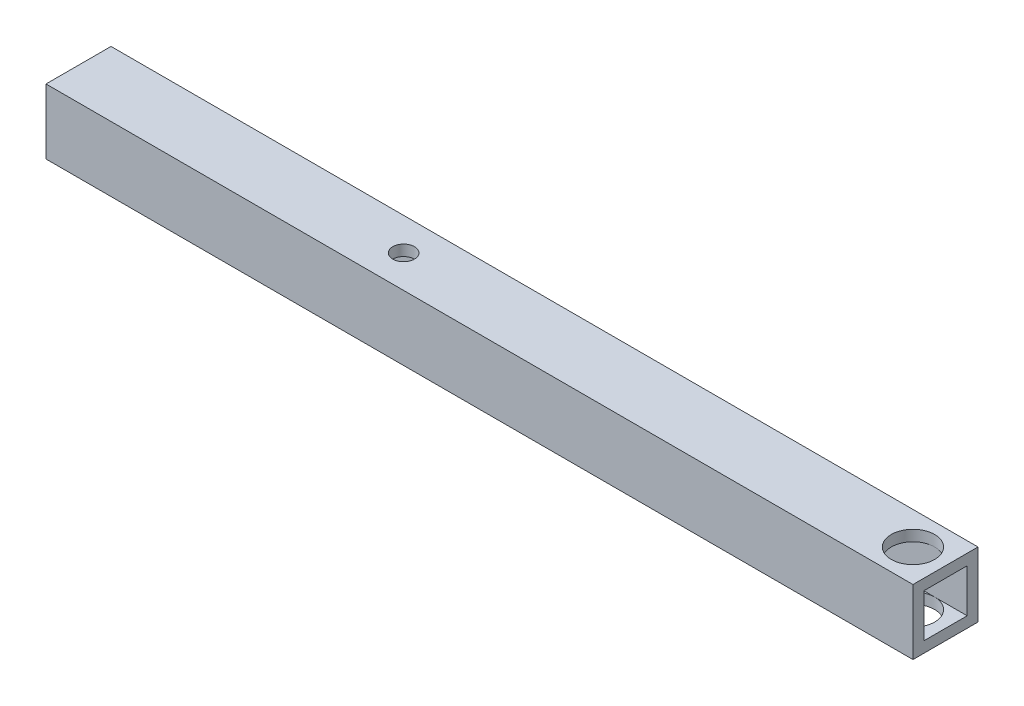
ISO-10303-21;
HEADER;
FILE_DESCRIPTION(('STEP AP214'),'2;1');
FILE_NAME('part.step','',(''),(''),'','','');
FILE_SCHEMA(('AUTOMOTIVE_DESIGN { 1 0 10303 214 1 1 1 1 }'));
ENDSEC;
DATA;
#1=APPLICATION_CONTEXT('core data for automotive mechanical design processes');
#2=APPLICATION_PROTOCOL_DEFINITION('international standard','automotive_design',2000,#1);
#3=PRODUCT_CONTEXT('',#1,'mechanical');
#4=PRODUCT('Part','Part','',(#3));
#5=PRODUCT_RELATED_PRODUCT_CATEGORY('part','',(#4));
#6=PRODUCT_DEFINITION_FORMATION('','',#4);
#7=PRODUCT_DEFINITION_CONTEXT('part definition',#1,'design');
#8=PRODUCT_DEFINITION('design','',#6,#7);
#9=PRODUCT_DEFINITION_SHAPE('','',#8);
#10=(LENGTH_UNIT() NAMED_UNIT(*) SI_UNIT(.MILLI.,.METRE.));
#11=(NAMED_UNIT(*) PLANE_ANGLE_UNIT() SI_UNIT($,.RADIAN.));
#12=(NAMED_UNIT(*) SI_UNIT($,.STERADIAN.) SOLID_ANGLE_UNIT());
#13=UNCERTAINTY_MEASURE_WITH_UNIT(LENGTH_MEASURE(1.E-05),#10,'distance_accuracy_value','');
#14=(GEOMETRIC_REPRESENTATION_CONTEXT(3) GLOBAL_UNCERTAINTY_ASSIGNED_CONTEXT((#13)) GLOBAL_UNIT_ASSIGNED_CONTEXT((#10,
#11,#12)) REPRESENTATION_CONTEXT('',''));
#15=CARTESIAN_POINT('',(0.,0.,0.));
#16=DIRECTION('',(0.,0.,1.));
#17=DIRECTION('',(1.,0.,0.));
#18=AXIS2_PLACEMENT_3D('',#15,#16,#17);
#19=CARTESIAN_POINT('',(200.,-5.,-5.));
#20=DIRECTION('',(0.,1.,0.));
#21=DIRECTION('',(0.,0.,1.));
#22=AXIS2_PLACEMENT_3D('',#19,#20,#21);
#23=PLANE('',#22);
#24=CARTESIAN_POINT('',(192.5,-5.,0.));
#25=DIRECTION('',(0.,1.,0.));
#26=DIRECTION('',(0.,0.,1.));
#27=AXIS2_PLACEMENT_3D('',#24,#25,#26);
#28=CIRCLE('',#27,4.99999999999999);
#29=CARTESIAN_POINT('',(192.5,-5.,5.));
#30=VERTEX_POINT('',#29);
#31=CARTESIAN_POINT('',(192.5,-5.,-5.));
#32=VERTEX_POINT('',#31);
#33=EDGE_CURVE('E55',#30,#32,#28,.T.);
#34=ORIENTED_EDGE('',*,*,#33,.F.);
#35=DIRECTION('',(-1.,0.,0.));
#36=VECTOR('',#35,1.);
#37=CARTESIAN_POINT('',(200.,-5.,5.));
#38=LINE('',#37,#36);
#39=CARTESIAN_POINT('',(200.,-5.,5.));
#40=VERTEX_POINT('',#39);
#41=EDGE_CURVE('E154',#40,#30,#38,.T.);
#42=ORIENTED_EDGE('',*,*,#41,.F.);
#43=DIRECTION('',(0.,0.,-1.));
#44=VECTOR('',#43,1.);
#45=CARTESIAN_POINT('',(200.,-5.,-5.));
#46=LINE('',#45,#44);
#47=CARTESIAN_POINT('',(200.,-5.,-5.));
#48=VERTEX_POINT('',#47);
#49=EDGE_CURVE('E227',#40,#48,#46,.T.);
#50=ORIENTED_EDGE('',*,*,#49,.T.);
#51=DIRECTION('',(-1.,0.,0.));
#52=VECTOR('',#51,1.);
#53=CARTESIAN_POINT('',(200.,-5.,-5.));
#54=LINE('',#53,#52);
#55=EDGE_CURVE('E146',#48,#32,#54,.T.);
#56=ORIENTED_EDGE('',*,*,#55,.T.);
#57=EDGE_LOOP('',(#34,#42,#50,#56));
#58=FACE_BOUND('',#57,.T.);
#59=ADVANCED_FACE('F39',(#58),#23,.T.);
#60=CARTESIAN_POINT('',(200.,5.,-5.));
#61=DIRECTION('',(0.,-1.,0.));
#62=DIRECTION('',(0.,0.,-1.));
#63=AXIS2_PLACEMENT_3D('',#60,#61,#62);
#64=PLANE('',#63);
#65=CARTESIAN_POINT('',(192.5,5.,0.));
#66=DIRECTION('',(0.,-1.,0.));
#67=DIRECTION('',(0.,0.,-1.));
#68=AXIS2_PLACEMENT_3D('',#65,#66,#67);
#69=CIRCLE('',#68,4.99999999999999);
#70=CARTESIAN_POINT('',(192.5,5.,-5.));
#71=VERTEX_POINT('',#70);
#72=CARTESIAN_POINT('',(192.5,5.,5.));
#73=VERTEX_POINT('',#72);
#74=EDGE_CURVE('E11',#71,#73,#69,.T.);
#75=ORIENTED_EDGE('',*,*,#74,.F.);
#76=DIRECTION('',(-1.,0.,0.));
#77=VECTOR('',#76,1.);
#78=CARTESIAN_POINT('',(200.,5.,-5.));
#79=LINE('',#78,#77);
#80=CARTESIAN_POINT('',(200.,5.,-5.));
#81=VERTEX_POINT('',#80);
#82=EDGE_CURVE('E124',#81,#71,#79,.T.);
#83=ORIENTED_EDGE('',*,*,#82,.F.);
#84=DIRECTION('',(0.,0.,1.));
#85=VECTOR('',#84,1.);
#86=CARTESIAN_POINT('',(200.,5.,-5.));
#87=LINE('',#86,#85);
#88=CARTESIAN_POINT('',(200.,5.,5.));
#89=VERTEX_POINT('',#88);
#90=EDGE_CURVE('E226',#81,#89,#87,.T.);
#91=ORIENTED_EDGE('',*,*,#90,.T.);
#92=DIRECTION('',(-1.,0.,0.));
#93=VECTOR('',#92,1.);
#94=CARTESIAN_POINT('',(200.,5.,5.));
#95=LINE('',#94,#93);
#96=EDGE_CURVE('E127',#89,#73,#95,.T.);
#97=ORIENTED_EDGE('',*,*,#96,.T.);
#98=EDGE_LOOP('',(#75,#83,#91,#97));
#99=FACE_BOUND('',#98,.T.);
#100=ADVANCED_FACE('F122',(#99),#64,.T.);
#101=CARTESIAN_POINT('',(200.,0.,0.));
#102=DIRECTION('',(-1.,0.,0.));
#103=DIRECTION('',(0.,0.,1.));
#104=AXIS2_PLACEMENT_3D('',#101,#102,#103);
#105=PLANE('',#104);
#106=DIRECTION('',(0.,1.,0.));
#107=VECTOR('',#106,1.);
#108=CARTESIAN_POINT('',(200.,-7.5,-7.5));
#109=LINE('',#108,#107);
#110=CARTESIAN_POINT('',(200.,-7.5,-7.5));
#111=VERTEX_POINT('',#110);
#112=CARTESIAN_POINT('',(200.,7.5,-7.5));
#113=VERTEX_POINT('',#112);
#114=EDGE_CURVE('E159',#111,#113,#109,.T.);
#115=ORIENTED_EDGE('',*,*,#114,.T.);
#116=DIRECTION('',(0.,0.,1.));
#117=VECTOR('',#116,1.);
#118=CARTESIAN_POINT('',(200.,7.5,7.5));
#119=LINE('',#118,#117);
#120=CARTESIAN_POINT('',(200.,7.5,7.5));
#121=VERTEX_POINT('',#120);
#122=EDGE_CURVE('E163',#113,#121,#119,.T.);
#123=ORIENTED_EDGE('',*,*,#122,.T.);
#124=DIRECTION('',(0.,-1.,0.));
#125=VECTOR('',#124,1.);
#126=CARTESIAN_POINT('',(200.,-7.5,7.5));
#127=LINE('',#126,#125);
#128=CARTESIAN_POINT('',(200.,-7.5,7.5));
#129=VERTEX_POINT('',#128);
#130=EDGE_CURVE('E167',#121,#129,#127,.T.);
#131=ORIENTED_EDGE('',*,*,#130,.T.);
#132=DIRECTION('',(0.,0.,-1.));
#133=VECTOR('',#132,1.);
#134=CARTESIAN_POINT('',(200.,-7.5,7.5));
#135=LINE('',#134,#133);
#136=EDGE_CURVE('E170',#129,#111,#135,.T.);
#137=ORIENTED_EDGE('',*,*,#136,.T.);
#138=EDGE_LOOP('',(#115,#123,#131,#137));
#139=FACE_BOUND('',#138,.T.);
#140=DIRECTION('',(0.,-1.,0.));
#141=VECTOR('',#140,1.);
#142=CARTESIAN_POINT('',(200.,-5.,5.));
#143=LINE('',#142,#141);
#144=EDGE_CURVE('E225',#89,#40,#143,.T.);
#145=ORIENTED_EDGE('',*,*,#144,.F.);
#146=ORIENTED_EDGE('',*,*,#90,.F.);
#147=DIRECTION('',(0.,1.,0.));
#148=VECTOR('',#147,1.);
#149=CARTESIAN_POINT('',(200.,-5.,-5.));
#150=LINE('',#149,#148);
#151=EDGE_CURVE('E141',#48,#81,#150,.T.);
#152=ORIENTED_EDGE('',*,*,#151,.F.);
#153=ORIENTED_EDGE('',*,*,#49,.F.);
#154=EDGE_LOOP('',(#145,#146,#152,#153));
#155=FACE_BOUND('',#154,.T.);
#156=ADVANCED_FACE('F219',(#139,#155),#105,.F.);
#157=CARTESIAN_POINT('',(0.,0.,0.));
#158=DIRECTION('',(-1.,0.,0.));
#159=DIRECTION('',(0.,0.,1.));
#160=AXIS2_PLACEMENT_3D('',#157,#158,#159);
#161=PLANE('',#160);
#162=DIRECTION('',(0.,1.,0.));
#163=VECTOR('',#162,1.);
#164=CARTESIAN_POINT('',(0.,-7.5,-7.5));
#165=LINE('',#164,#163);
#166=CARTESIAN_POINT('',(0.,-7.5,-7.5));
#167=VERTEX_POINT('',#166);
#168=CARTESIAN_POINT('',(0.,7.5,-7.5));
#169=VERTEX_POINT('',#168);
#170=EDGE_CURVE('E158',#167,#169,#165,.T.);
#171=ORIENTED_EDGE('',*,*,#170,.F.);
#172=DIRECTION('',(0.,0.,-1.));
#173=VECTOR('',#172,1.);
#174=CARTESIAN_POINT('',(0.,-7.5,7.5));
#175=LINE('',#174,#173);
#176=CARTESIAN_POINT('',(0.,-7.5,7.5));
#177=VERTEX_POINT('',#176);
#178=EDGE_CURVE('E164',#177,#167,#175,.T.);
#179=ORIENTED_EDGE('',*,*,#178,.F.);
#180=DIRECTION('',(0.,-1.,0.));
#181=VECTOR('',#180,1.);
#182=CARTESIAN_POINT('',(0.,-7.5,7.5));
#183=LINE('',#182,#181);
#184=CARTESIAN_POINT('',(0.,7.5,7.5));
#185=VERTEX_POINT('',#184);
#186=EDGE_CURVE('E180',#185,#177,#183,.T.);
#187=ORIENTED_EDGE('',*,*,#186,.F.);
#188=DIRECTION('',(0.,0.,1.));
#189=VECTOR('',#188,1.);
#190=CARTESIAN_POINT('',(0.,7.5,7.5));
#191=LINE('',#190,#189);
#192=EDGE_CURVE('E177',#169,#185,#191,.T.);
#193=ORIENTED_EDGE('',*,*,#192,.F.);
#194=EDGE_LOOP('',(#171,#179,#187,#193));
#195=FACE_BOUND('',#194,.T.);
#196=DIRECTION('',(0.,0.,1.));
#197=VECTOR('',#196,1.);
#198=CARTESIAN_POINT('',(0.,5.,-5.));
#199=LINE('',#198,#197);
#200=CARTESIAN_POINT('',(0.,5.,-5.));
#201=VERTEX_POINT('',#200);
#202=CARTESIAN_POINT('',(0.,5.,5.));
#203=VERTEX_POINT('',#202);
#204=EDGE_CURVE('E132',#201,#203,#199,.T.);
#205=ORIENTED_EDGE('',*,*,#204,.T.);
#206=DIRECTION('',(0.,-1.,0.));
#207=VECTOR('',#206,1.);
#208=CARTESIAN_POINT('',(0.,-5.,5.));
#209=LINE('',#208,#207);
#210=CARTESIAN_POINT('',(0.,-5.,5.));
#211=VERTEX_POINT('',#210);
#212=EDGE_CURVE('E245',#203,#211,#209,.T.);
#213=ORIENTED_EDGE('',*,*,#212,.T.);
#214=DIRECTION('',(0.,0.,-1.));
#215=VECTOR('',#214,1.);
#216=CARTESIAN_POINT('',(0.,-5.,-5.));
#217=LINE('',#216,#215);
#218=CARTESIAN_POINT('',(0.,-5.,-5.));
#219=VERTEX_POINT('',#218);
#220=EDGE_CURVE('E249',#211,#219,#217,.T.);
#221=ORIENTED_EDGE('',*,*,#220,.T.);
#222=DIRECTION('',(0.,1.,0.));
#223=VECTOR('',#222,1.);
#224=CARTESIAN_POINT('',(0.,-5.,-5.));
#225=LINE('',#224,#223);
#226=EDGE_CURVE('E235',#219,#201,#225,.T.);
#227=ORIENTED_EDGE('',*,*,#226,.T.);
#228=EDGE_LOOP('',(#205,#213,#221,#227));
#229=FACE_BOUND('',#228,.T.);
#230=ADVANCED_FACE('F208',(#195,#229),#161,.T.);
#231=CARTESIAN_POINT('',(200.,-7.5,-7.5));
#232=DIRECTION('',(0.,0.,1.));
#233=DIRECTION('',(1.,0.,0.));
#234=AXIS2_PLACEMENT_3D('',#231,#232,#233);
#235=PLANE('',#234);
#236=ORIENTED_EDGE('',*,*,#170,.T.);
#237=DIRECTION('',(-1.,0.,0.));
#238=VECTOR('',#237,1.);
#239=CARTESIAN_POINT('',(200.,7.5,-7.5));
#240=LINE('',#239,#238);
#241=EDGE_CURVE('E119',#113,#169,#240,.T.);
#242=ORIENTED_EDGE('',*,*,#241,.F.);
#243=ORIENTED_EDGE('',*,*,#114,.F.);
#244=DIRECTION('',(-1.,0.,0.));
#245=VECTOR('',#244,1.);
#246=CARTESIAN_POINT('',(200.,-7.5,-7.5));
#247=LINE('',#246,#245);
#248=EDGE_CURVE('E173',#111,#167,#247,.T.);
#249=ORIENTED_EDGE('',*,*,#248,.T.);
#250=EDGE_LOOP('',(#236,#242,#243,#249));
#251=FACE_BOUND('',#250,.T.);
#252=ADVANCED_FACE('F41',(#251),#235,.F.);
#253=CARTESIAN_POINT('',(200.,7.5,7.5));
#254=DIRECTION('',(0.,-1.,0.));
#255=DIRECTION('',(0.,0.,-1.));
#256=AXIS2_PLACEMENT_3D('',#253,#254,#255);
#257=PLANE('',#256);
#258=CARTESIAN_POINT('',(75.,7.5,0.));
#259=DIRECTION('',(0.,1.,0.));
#260=DIRECTION('',(0.,0.,1.));
#261=AXIS2_PLACEMENT_3D('',#258,#259,#260);
#262=CIRCLE('',#261,2.49999999999999);
#263=CARTESIAN_POINT('',(75.,7.5,2.49999999999999));
#264=VERTEX_POINT('',#263);
#265=EDGE_CURVE('E292',#264,#264,#262,.T.);
#266=ORIENTED_EDGE('',*,*,#265,.F.);
#267=EDGE_LOOP('',(#266));
#268=FACE_BOUND('',#267,.T.);
#269=CARTESIAN_POINT('',(192.5,7.5,0.));
#270=DIRECTION('',(0.,1.,0.));
#271=DIRECTION('',(0.,0.,1.));
#272=AXIS2_PLACEMENT_3D('',#269,#270,#271);
#273=CIRCLE('',#272,4.99999999999999);
#274=CARTESIAN_POINT('',(192.5,7.5,4.99999999999999));
#275=VERTEX_POINT('',#274);
#276=EDGE_CURVE('E306',#275,#275,#273,.T.);
#277=ORIENTED_EDGE('',*,*,#276,.F.);
#278=EDGE_LOOP('',(#277));
#279=FACE_BOUND('',#278,.T.);
#280=ORIENTED_EDGE('',*,*,#192,.T.);
#281=DIRECTION('',(-1.,0.,0.));
#282=VECTOR('',#281,1.);
#283=CARTESIAN_POINT('',(200.,7.5,7.5));
#284=LINE('',#283,#282);
#285=EDGE_CURVE('E192',#121,#185,#284,.T.);
#286=ORIENTED_EDGE('',*,*,#285,.F.);
#287=ORIENTED_EDGE('',*,*,#122,.F.);
#288=ORIENTED_EDGE('',*,*,#241,.T.);
#289=EDGE_LOOP('',(#280,#286,#287,#288));
#290=FACE_BOUND('',#289,.T.);
#291=ADVANCED_FACE('F200',(#268,#279,#290),#257,.F.);
#292=CARTESIAN_POINT('',(200.,-7.5,7.5));
#293=DIRECTION('',(0.,0.,-1.));
#294=DIRECTION('',(-1.,0.,0.));
#295=AXIS2_PLACEMENT_3D('',#292,#293,#294);
#296=PLANE('',#295);
#297=ORIENTED_EDGE('',*,*,#186,.T.);
#298=DIRECTION('',(-1.,0.,0.));
#299=VECTOR('',#298,1.);
#300=CARTESIAN_POINT('',(200.,-7.5,7.5));
#301=LINE('',#300,#299);
#302=EDGE_CURVE('E188',#129,#177,#301,.T.);
#303=ORIENTED_EDGE('',*,*,#302,.F.);
#304=ORIENTED_EDGE('',*,*,#130,.F.);
#305=ORIENTED_EDGE('',*,*,#285,.T.);
#306=EDGE_LOOP('',(#297,#303,#304,#305));
#307=FACE_BOUND('',#306,.T.);
#308=ADVANCED_FACE('F213',(#307),#296,.F.);
#309=CARTESIAN_POINT('',(200.,-7.5,7.5));
#310=DIRECTION('',(0.,1.,0.));
#311=DIRECTION('',(0.,0.,1.));
#312=AXIS2_PLACEMENT_3D('',#309,#310,#311);
#313=PLANE('',#312);
#314=CARTESIAN_POINT('',(75.,-7.50000000000001,0.));
#315=DIRECTION('',(0.,1.,0.));
#316=DIRECTION('',(0.,0.,1.));
#317=AXIS2_PLACEMENT_3D('',#314,#315,#316);
#318=CIRCLE('',#317,2.49999999999999);
#319=CARTESIAN_POINT('',(75.,-7.50000000000001,2.49999999999999));
#320=VERTEX_POINT('',#319);
#321=EDGE_CURVE('E296',#320,#320,#318,.T.);
#322=ORIENTED_EDGE('',*,*,#321,.T.);
#323=EDGE_LOOP('',(#322));
#324=FACE_BOUND('',#323,.T.);
#325=CARTESIAN_POINT('',(192.5,-7.5,0.));
#326=DIRECTION('',(0.,1.,0.));
#327=DIRECTION('',(0.,0.,1.));
#328=AXIS2_PLACEMENT_3D('',#325,#326,#327);
#329=CIRCLE('',#328,4.99999999999999);
#330=CARTESIAN_POINT('',(192.5,-7.5,4.99999999999999));
#331=VERTEX_POINT('',#330);
#332=EDGE_CURVE('E307',#331,#331,#329,.T.);
#333=ORIENTED_EDGE('',*,*,#332,.T.);
#334=EDGE_LOOP('',(#333));
#335=FACE_BOUND('',#334,.T.);
#336=ORIENTED_EDGE('',*,*,#178,.T.);
#337=ORIENTED_EDGE('',*,*,#248,.F.);
#338=ORIENTED_EDGE('',*,*,#136,.F.);
#339=ORIENTED_EDGE('',*,*,#302,.T.);
#340=EDGE_LOOP('',(#336,#337,#338,#339));
#341=FACE_BOUND('',#340,.T.);
#342=ADVANCED_FACE('F217',(#324,#335,#341),#313,.F.);
#343=CARTESIAN_POINT('',(200.,-5.,5.));
#344=DIRECTION('',(0.,0.,-1.));
#345=DIRECTION('',(-1.,0.,0.));
#346=AXIS2_PLACEMENT_3D('',#343,#344,#345);
#347=PLANE('',#346);
#348=EDGE_CURVE('E244',#73,#203,#95,.T.);
#349=ORIENTED_EDGE('',*,*,#348,.F.);
#350=ORIENTED_EDGE('',*,*,#96,.F.);
#351=ORIENTED_EDGE('',*,*,#144,.T.);
#352=ORIENTED_EDGE('',*,*,#41,.T.);
#353=EDGE_CURVE('E153',#30,#211,#38,.T.);
#354=ORIENTED_EDGE('',*,*,#353,.T.);
#355=ORIENTED_EDGE('',*,*,#212,.F.);
#356=EDGE_LOOP('',(#349,#350,#351,#352,#354,#355));
#357=FACE_BOUND('',#356,.T.);
#358=ADVANCED_FACE('F259',(#357),#347,.T.);
#359=CARTESIAN_POINT('',(75.,-5.,0.));
#360=DIRECTION('',(0.,1.,0.));
#361=DIRECTION('',(0.,0.,1.));
#362=AXIS2_PLACEMENT_3D('',#359,#360,#361);
#363=CIRCLE('',#362,2.49999999999999);
#364=CARTESIAN_POINT('',(75.,-5.,2.49999999999999));
#365=VERTEX_POINT('',#364);
#366=EDGE_CURVE('E291',#365,#365,#363,.T.);
#367=ORIENTED_EDGE('',*,*,#366,.F.);
#368=EDGE_LOOP('',(#367));
#369=FACE_BOUND('',#368,.T.);
#370=EDGE_CURVE('E237',#32,#30,#28,.T.);
#371=ORIENTED_EDGE('',*,*,#370,.F.);
#372=EDGE_CURVE('E144',#32,#219,#54,.T.);
#373=ORIENTED_EDGE('',*,*,#372,.T.);
#374=ORIENTED_EDGE('',*,*,#220,.F.);
#375=ORIENTED_EDGE('',*,*,#353,.F.);
#376=EDGE_LOOP('',(#371,#373,#374,#375));
#377=FACE_BOUND('',#376,.T.);
#378=ADVANCED_FACE('F262',(#369,#377),#23,.T.);
#379=CARTESIAN_POINT('',(200.,-5.,-5.));
#380=DIRECTION('',(0.,0.,1.));
#381=DIRECTION('',(1.,0.,0.));
#382=AXIS2_PLACEMENT_3D('',#379,#380,#381);
#383=PLANE('',#382);
#384=ORIENTED_EDGE('',*,*,#82,.T.);
#385=EDGE_CURVE('E129',#71,#201,#79,.T.);
#386=ORIENTED_EDGE('',*,*,#385,.T.);
#387=ORIENTED_EDGE('',*,*,#226,.F.);
#388=ORIENTED_EDGE('',*,*,#372,.F.);
#389=ORIENTED_EDGE('',*,*,#55,.F.);
#390=ORIENTED_EDGE('',*,*,#151,.T.);
#391=EDGE_LOOP('',(#384,#386,#387,#388,#389,#390));
#392=FACE_BOUND('',#391,.T.);
#393=ADVANCED_FACE('F138',(#392),#383,.T.);
#394=CARTESIAN_POINT('',(75.,5.,0.));
#395=DIRECTION('',(0.,-1.,0.));
#396=DIRECTION('',(0.,0.,-1.));
#397=AXIS2_PLACEMENT_3D('',#394,#395,#396);
#398=CIRCLE('',#397,2.49999999999999);
#399=CARTESIAN_POINT('',(75.,5.,-2.49999999999999));
#400=VERTEX_POINT('',#399);
#401=EDGE_CURVE('E43',#400,#400,#398,.T.);
#402=ORIENTED_EDGE('',*,*,#401,.F.);
#403=EDGE_LOOP('',(#402));
#404=FACE_BOUND('',#403,.T.);
#405=EDGE_CURVE('E49',#73,#71,#69,.T.);
#406=ORIENTED_EDGE('',*,*,#405,.F.);
#407=ORIENTED_EDGE('',*,*,#348,.T.);
#408=ORIENTED_EDGE('',*,*,#204,.F.);
#409=ORIENTED_EDGE('',*,*,#385,.F.);
#410=EDGE_LOOP('',(#406,#407,#408,#409));
#411=FACE_BOUND('',#410,.T.);
#412=ADVANCED_FACE('F130',(#404,#411),#64,.T.);
#413=CARTESIAN_POINT('',(192.5,-7.5,0.));
#414=DIRECTION('',(0.,1.,0.));
#415=DIRECTION('',(0.,0.,1.));
#416=AXIS2_PLACEMENT_3D('',#413,#414,#415);
#417=CYLINDRICAL_SURFACE('',#416,4.99999999999999);
#418=ORIENTED_EDGE('',*,*,#74,.T.);
#419=ORIENTED_EDGE('',*,*,#405,.T.);
#420=EDGE_LOOP('',(#418,#419));
#421=FACE_BOUND('',#420,.T.);
#422=ORIENTED_EDGE('',*,*,#276,.T.);
#423=EDGE_LOOP('',(#422));
#424=FACE_BOUND('',#423,.T.);
#425=ADVANCED_FACE('F113',(#421,#424),#417,.F.);
#426=ORIENTED_EDGE('',*,*,#33,.T.);
#427=ORIENTED_EDGE('',*,*,#370,.T.);
#428=EDGE_LOOP('',(#426,#427));
#429=FACE_BOUND('',#428,.T.);
#430=ORIENTED_EDGE('',*,*,#332,.F.);
#431=EDGE_LOOP('',(#430));
#432=FACE_BOUND('',#431,.T.);
#433=ADVANCED_FACE('F286',(#429,#432),#417,.F.);
#434=CARTESIAN_POINT('',(75.,-92.5,0.));
#435=DIRECTION('',(0.,1.,0.));
#436=DIRECTION('',(0.,0.,1.));
#437=AXIS2_PLACEMENT_3D('',#434,#435,#436);
#438=CYLINDRICAL_SURFACE('',#437,2.49999999999999);
#439=ORIENTED_EDGE('',*,*,#401,.T.);
#440=EDGE_LOOP('',(#439));
#441=FACE_BOUND('',#440,.T.);
#442=ORIENTED_EDGE('',*,*,#265,.T.);
#443=EDGE_LOOP('',(#442));
#444=FACE_BOUND('',#443,.T.);
#445=ADVANCED_FACE('F378',(#441,#444),#438,.F.);
#446=ORIENTED_EDGE('',*,*,#366,.T.);
#447=EDGE_LOOP('',(#446));
#448=FACE_BOUND('',#447,.T.);
#449=ORIENTED_EDGE('',*,*,#321,.F.);
#450=EDGE_LOOP('',(#449));
#451=FACE_BOUND('',#450,.T.);
#452=ADVANCED_FACE('F401',(#448,#451),#438,.F.);
#453=CLOSED_SHELL('',(#59,#100,#156,#230,#252,#291,#308,#342,#358,#378,#393,#412,#425,#433,#445,#452));
#454=MANIFOLD_SOLID_BREP('B2',#453);
#455=ADVANCED_BREP_SHAPE_REPRESENTATION('',(#18,#454),#14);
#456=SHAPE_DEFINITION_REPRESENTATION(#9,#455);
ENDSEC;
END-ISO-10303-21;
